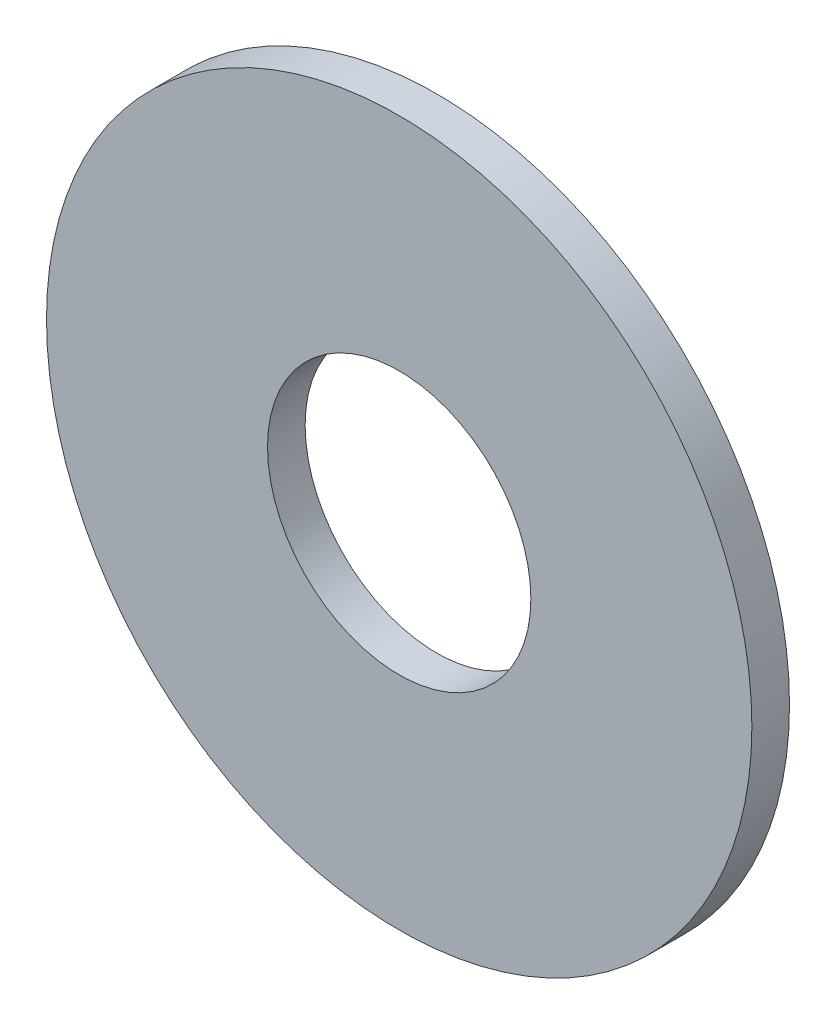
ISO-10303-21;
HEADER;
FILE_DESCRIPTION(('STEP AP214'),'2;1');
FILE_NAME('part.step','',(''),(''),'','','');
FILE_SCHEMA(('AUTOMOTIVE_DESIGN { 1 0 10303 214 1 1 1 1 }'));
ENDSEC;
DATA;
#1=APPLICATION_CONTEXT('core data for automotive mechanical design processes');
#2=APPLICATION_PROTOCOL_DEFINITION('international standard','automotive_design',2000,#1);
#3=PRODUCT_CONTEXT('',#1,'mechanical');
#4=PRODUCT('Part','Part','',(#3));
#5=PRODUCT_RELATED_PRODUCT_CATEGORY('part','',(#4));
#6=PRODUCT_DEFINITION_FORMATION('','',#4);
#7=PRODUCT_DEFINITION_CONTEXT('part definition',#1,'design');
#8=PRODUCT_DEFINITION('design','',#6,#7);
#9=PRODUCT_DEFINITION_SHAPE('','',#8);
#10=(LENGTH_UNIT() NAMED_UNIT(*) SI_UNIT(.MILLI.,.METRE.));
#11=(NAMED_UNIT(*) PLANE_ANGLE_UNIT() SI_UNIT($,.RADIAN.));
#12=(NAMED_UNIT(*) SI_UNIT($,.STERADIAN.) SOLID_ANGLE_UNIT());
#13=UNCERTAINTY_MEASURE_WITH_UNIT(LENGTH_MEASURE(1.E-05),#10,'distance_accuracy_value','');
#14=(GEOMETRIC_REPRESENTATION_CONTEXT(3) GLOBAL_UNCERTAINTY_ASSIGNED_CONTEXT((#13)) GLOBAL_UNIT_ASSIGNED_CONTEXT((#10,
#11,#12)) REPRESENTATION_CONTEXT('',''));
#15=CARTESIAN_POINT('',(0.,0.,0.));
#16=DIRECTION('',(0.,0.,1.));
#17=DIRECTION('',(1.,0.,0.));
#18=AXIS2_PLACEMENT_3D('',#15,#16,#17);
#19=CARTESIAN_POINT('',(0.,0.,-0.508));
#20=DIRECTION('',(0.,0.,1.));
#21=DIRECTION('',(1.,0.,0.));
#22=AXIS2_PLACEMENT_3D('',#19,#20,#21);
#23=CYLINDRICAL_SURFACE('',#22,4.7625);
#24=CARTESIAN_POINT('',(0.,0.,-0.508));
#25=DIRECTION('',(0.,0.,1.));
#26=DIRECTION('',(1.,0.,0.));
#27=AXIS2_PLACEMENT_3D('',#24,#25,#26);
#28=CIRCLE('',#27,4.7625);
#29=CARTESIAN_POINT('',(4.7625,0.,-0.508));
#30=VERTEX_POINT('',#29);
#31=EDGE_CURVE('E10',#30,#30,#28,.T.);
#32=ORIENTED_EDGE('',*,*,#31,.T.);
#33=EDGE_LOOP('',(#32));
#34=FACE_BOUND('',#33,.T.);
#35=CARTESIAN_POINT('',(0.,0.,0.));
#36=DIRECTION('',(0.,0.,1.));
#37=DIRECTION('',(1.,0.,0.));
#38=AXIS2_PLACEMENT_3D('',#35,#36,#37);
#39=CIRCLE('',#38,4.7625);
#40=CARTESIAN_POINT('',(4.7625,0.,0.));
#41=VERTEX_POINT('',#40);
#42=EDGE_CURVE('E33',#41,#41,#39,.T.);
#43=ORIENTED_EDGE('',*,*,#42,.F.);
#44=EDGE_LOOP('',(#43));
#45=FACE_BOUND('',#44,.T.);
#46=ADVANCED_FACE('F30',(#34,#45),#23,.T.);
#47=CARTESIAN_POINT('',(0.,0.,-0.508));
#48=DIRECTION('',(0.,0.,1.));
#49=DIRECTION('',(1.,0.,0.));
#50=AXIS2_PLACEMENT_3D('',#47,#48,#49);
#51=PLANE('',#50);
#52=CARTESIAN_POINT('',(0.,0.,-0.508));
#53=DIRECTION('',(0.,0.,1.));
#54=DIRECTION('',(1.,0.,0.));
#55=AXIS2_PLACEMENT_3D('',#52,#53,#54);
#56=CIRCLE('',#55,1.778);
#57=CARTESIAN_POINT('',(1.778,0.,-0.508));
#58=VERTEX_POINT('',#57);
#59=EDGE_CURVE('E40',#58,#58,#56,.T.);
#60=ORIENTED_EDGE('',*,*,#59,.T.);
#61=EDGE_LOOP('',(#60));
#62=FACE_BOUND('',#61,.T.);
#63=ORIENTED_EDGE('',*,*,#31,.F.);
#64=EDGE_LOOP('',(#63));
#65=FACE_BOUND('',#64,.T.);
#66=ADVANCED_FACE('F48',(#62,#65),#51,.F.);
#67=CARTESIAN_POINT('',(0.,0.,0.));
#68=DIRECTION('',(0.,0.,1.));
#69=DIRECTION('',(1.,0.,0.));
#70=AXIS2_PLACEMENT_3D('',#67,#68,#69);
#71=PLANE('',#70);
#72=CARTESIAN_POINT('',(0.,0.,0.));
#73=DIRECTION('',(0.,0.,1.));
#74=DIRECTION('',(1.,0.,0.));
#75=AXIS2_PLACEMENT_3D('',#72,#73,#74);
#76=CIRCLE('',#75,1.778);
#77=CARTESIAN_POINT('',(1.778,0.,0.));
#78=VERTEX_POINT('',#77);
#79=EDGE_CURVE('E42',#78,#78,#76,.T.);
#80=ORIENTED_EDGE('',*,*,#79,.F.);
#81=EDGE_LOOP('',(#80));
#82=FACE_BOUND('',#81,.T.);
#83=ORIENTED_EDGE('',*,*,#42,.T.);
#84=EDGE_LOOP('',(#83));
#85=FACE_BOUND('',#84,.T.);
#86=ADVANCED_FACE('F54',(#82,#85),#71,.T.);
#87=CARTESIAN_POINT('',(0.,0.,-0.508));
#88=DIRECTION('',(0.,0.,1.));
#89=DIRECTION('',(1.,0.,0.));
#90=AXIS2_PLACEMENT_3D('',#87,#88,#89);
#91=CYLINDRICAL_SURFACE('',#90,1.778);
#92=ORIENTED_EDGE('',*,*,#59,.F.);
#93=EDGE_LOOP('',(#92));
#94=FACE_BOUND('',#93,.T.);
#95=ORIENTED_EDGE('',*,*,#79,.T.);
#96=EDGE_LOOP('',(#95));
#97=FACE_BOUND('',#96,.T.);
#98=ADVANCED_FACE('F51',(#94,#97),#91,.F.);
#99=CLOSED_SHELL('',(#46,#66,#86,#98));
#100=MANIFOLD_SOLID_BREP('B2',#99);
#101=ADVANCED_BREP_SHAPE_REPRESENTATION('',(#18,#100),#14);
#102=SHAPE_DEFINITION_REPRESENTATION(#9,#101);
ENDSEC;
END-ISO-10303-21;
